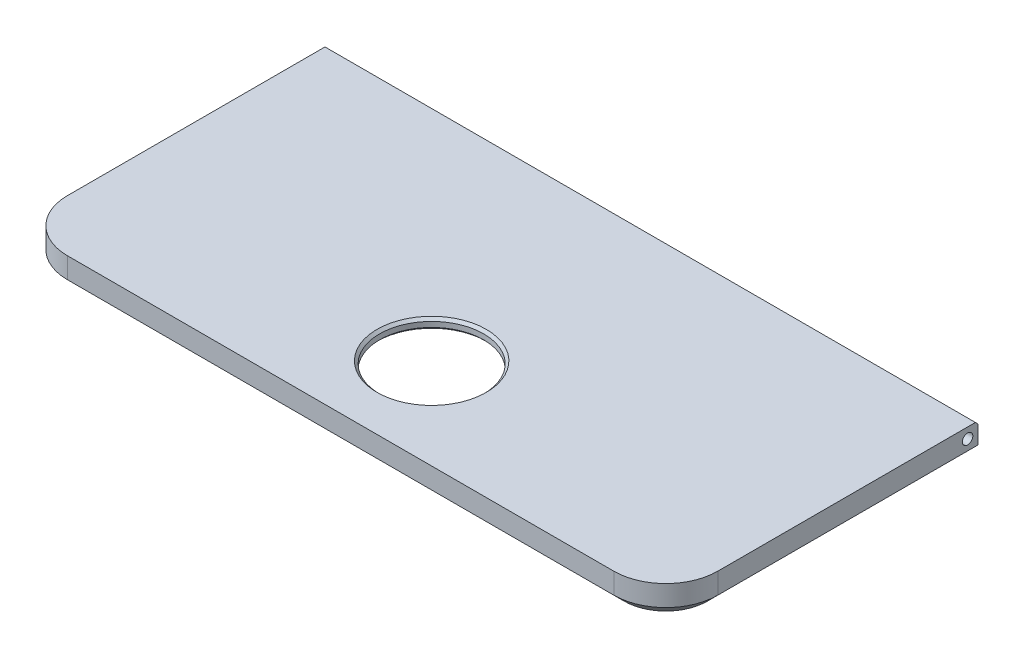
ISO-10303-21;
HEADER;
FILE_DESCRIPTION(('STEP AP214'),'2;1');
FILE_NAME('part.step','',(''),(''),'','','');
FILE_SCHEMA(('AUTOMOTIVE_DESIGN { 1 0 10303 214 1 1 1 1 }'));
ENDSEC;
DATA;
#1=APPLICATION_CONTEXT('core data for automotive mechanical design processes');
#2=APPLICATION_PROTOCOL_DEFINITION('international standard','automotive_design',2000,#1);
#3=PRODUCT_CONTEXT('',#1,'mechanical');
#4=PRODUCT('Part','Part','',(#3));
#5=PRODUCT_RELATED_PRODUCT_CATEGORY('part','',(#4));
#6=PRODUCT_DEFINITION_FORMATION('','',#4);
#7=PRODUCT_DEFINITION_CONTEXT('part definition',#1,'design');
#8=PRODUCT_DEFINITION('design','',#6,#7);
#9=PRODUCT_DEFINITION_SHAPE('','',#8);
#10=(LENGTH_UNIT() NAMED_UNIT(*) SI_UNIT(.MILLI.,.METRE.));
#11=(NAMED_UNIT(*) PLANE_ANGLE_UNIT() SI_UNIT($,.RADIAN.));
#12=(NAMED_UNIT(*) SI_UNIT($,.STERADIAN.) SOLID_ANGLE_UNIT());
#13=UNCERTAINTY_MEASURE_WITH_UNIT(LENGTH_MEASURE(1.E-05),#10,'distance_accuracy_value','');
#14=(GEOMETRIC_REPRESENTATION_CONTEXT(3) GLOBAL_UNCERTAINTY_ASSIGNED_CONTEXT((#13)) GLOBAL_UNIT_ASSIGNED_CONTEXT((#10,
#11,#12)) REPRESENTATION_CONTEXT('',''));
#15=CARTESIAN_POINT('',(0.,0.,0.));
#16=DIRECTION('',(0.,0.,1.));
#17=DIRECTION('',(1.,0.,0.));
#18=AXIS2_PLACEMENT_3D('',#15,#16,#17);
#19=CARTESIAN_POINT('',(59.,4.,-26.5));
#20=DIRECTION('',(1.,0.,0.));
#21=DIRECTION('',(0.,0.,-1.));
#22=AXIS2_PLACEMENT_3D('',#19,#20,#21);
#23=PLANE('',#22);
#24=DIRECTION('',(0.,1.,0.));
#25=VECTOR('',#24,1.);
#26=CARTESIAN_POINT('',(59.,-118.009533513187,-25.));
#27=LINE('',#26,#25);
#28=CARTESIAN_POINT('',(59.,0.,-25.));
#29=VERTEX_POINT('',#28);
#30=CARTESIAN_POINT('',(59.,4.,-25.));
#31=VERTEX_POINT('',#30);
#32=EDGE_CURVE('E148',#29,#31,#27,.T.);
#33=ORIENTED_EDGE('',*,*,#32,.F.);
#34=DIRECTION('',(0.,0.,1.));
#35=VECTOR('',#34,1.);
#36=CARTESIAN_POINT('',(59.,0.,-26.5));
#37=LINE('',#36,#35);
#38=CARTESIAN_POINT('',(59.,0.,20.));
#39=VERTEX_POINT('',#38);
#40=EDGE_CURVE('E162',#29,#39,#37,.T.);
#41=ORIENTED_EDGE('',*,*,#40,.T.);
#42=DIRECTION('',(0.,-1.,0.));
#43=VECTOR('',#42,1.);
#44=CARTESIAN_POINT('',(59.,4.,20.));
#45=LINE('',#44,#43);
#46=CARTESIAN_POINT('',(59.,4.,20.));
#47=VERTEX_POINT('',#46);
#48=EDGE_CURVE('E188',#47,#39,#45,.T.);
#49=ORIENTED_EDGE('',*,*,#48,.F.);
#50=DIRECTION('',(0.,0.,1.));
#51=VECTOR('',#50,1.);
#52=CARTESIAN_POINT('',(59.,4.,-26.5));
#53=LINE('',#52,#51);
#54=EDGE_CURVE('E164',#31,#47,#53,.T.);
#55=ORIENTED_EDGE('',*,*,#54,.F.);
#56=EDGE_LOOP('',(#33,#41,#49,#55));
#57=FACE_BOUND('',#56,.T.);
#58=ADVANCED_FACE('F35',(#57),#23,.F.);
#59=CARTESIAN_POINT('',(-59.,4.,20.));
#60=DIRECTION('',(-1.,0.,0.));
#61=DIRECTION('',(0.,0.,1.));
#62=AXIS2_PLACEMENT_3D('',#59,#60,#61);
#63=PLANE('',#62);
#64=DIRECTION('',(0.,1.,0.));
#65=VECTOR('',#64,1.);
#66=CARTESIAN_POINT('',(-59.,-118.009533513187,-25.));
#67=LINE('',#66,#65);
#68=CARTESIAN_POINT('',(-59.,0.,-25.));
#69=VERTEX_POINT('',#68);
#70=CARTESIAN_POINT('',(-59.,4.,-25.));
#71=VERTEX_POINT('',#70);
#72=EDGE_CURVE('E151',#69,#71,#67,.T.);
#73=ORIENTED_EDGE('',*,*,#72,.T.);
#74=DIRECTION('',(0.,0.,-1.));
#75=VECTOR('',#74,1.);
#76=CARTESIAN_POINT('',(-59.,4.,20.));
#77=LINE('',#76,#75);
#78=CARTESIAN_POINT('',(-59.,4.,20.));
#79=VERTEX_POINT('',#78);
#80=EDGE_CURVE('E599',#79,#71,#77,.T.);
#81=ORIENTED_EDGE('',*,*,#80,.F.);
#82=DIRECTION('',(0.,-1.,0.));
#83=VECTOR('',#82,1.);
#84=CARTESIAN_POINT('',(-59.,4.,20.));
#85=LINE('',#84,#83);
#86=CARTESIAN_POINT('',(-59.,0.,20.));
#87=VERTEX_POINT('',#86);
#88=EDGE_CURVE('E190',#79,#87,#85,.T.);
#89=ORIENTED_EDGE('',*,*,#88,.T.);
#90=DIRECTION('',(0.,0.,-1.));
#91=VECTOR('',#90,1.);
#92=CARTESIAN_POINT('',(-59.,0.,20.));
#93=LINE('',#92,#91);
#94=EDGE_CURVE('E172',#87,#69,#93,.T.);
#95=ORIENTED_EDGE('',*,*,#94,.T.);
#96=EDGE_LOOP('',(#73,#81,#89,#95));
#97=FACE_BOUND('',#96,.T.);
#98=ADVANCED_FACE('F304',(#97),#63,.F.);
#99=CARTESIAN_POINT('',(-52.5,4.,20.));
#100=DIRECTION('',(0.,-1.,0.));
#101=DIRECTION('',(0.,0.,-1.));
#102=AXIS2_PLACEMENT_3D('',#99,#100,#101);
#103=PLANE('',#102);
#104=CARTESIAN_POINT('',(0.,4.,12.5));
#105=DIRECTION('',(0.,-1.,0.));
#106=DIRECTION('',(0.,0.,-1.));
#107=AXIS2_PLACEMENT_3D('',#104,#105,#106);
#108=CIRCLE('',#107,10.5);
#109=CARTESIAN_POINT('',(0.,4.,2.00000000000001));
#110=VERTEX_POINT('',#109);
#111=EDGE_CURVE('E269',#110,#110,#108,.F.);
#112=ORIENTED_EDGE('',*,*,#111,.T.);
#113=EDGE_LOOP('',(#112));
#114=FACE_BOUND('',#113,.T.);
#115=ORIENTED_EDGE('',*,*,#80,.T.);
#116=DIRECTION('',(-1.,0.,0.));
#117=VECTOR('',#116,1.);
#118=CARTESIAN_POINT('',(-59.,4.,-25.));
#119=LINE('',#118,#117);
#120=EDGE_CURVE('E157',#31,#71,#119,.T.);
#121=ORIENTED_EDGE('',*,*,#120,.F.);
#122=ORIENTED_EDGE('',*,*,#54,.T.);
#123=CARTESIAN_POINT('',(52.5,4.,20.));
#124=DIRECTION('',(0.,-1.,0.));
#125=DIRECTION('',(0.,0.,-1.));
#126=AXIS2_PLACEMENT_3D('',#123,#124,#125);
#127=CIRCLE('',#126,6.5);
#128=CARTESIAN_POINT('',(52.5,4.,26.5));
#129=VERTEX_POINT('',#128);
#130=EDGE_CURVE('E595',#47,#129,#127,.T.);
#131=ORIENTED_EDGE('',*,*,#130,.T.);
#132=DIRECTION('',(-1.,0.,0.));
#133=VECTOR('',#132,1.);
#134=CARTESIAN_POINT('',(52.5,4.,26.5));
#135=LINE('',#134,#133);
#136=CARTESIAN_POINT('',(-52.5,4.,26.5));
#137=VERTEX_POINT('',#136);
#138=EDGE_CURVE('E193',#129,#137,#135,.T.);
#139=ORIENTED_EDGE('',*,*,#138,.T.);
#140=CARTESIAN_POINT('',(-52.5,4.,20.));
#141=DIRECTION('',(0.,-1.,0.));
#142=DIRECTION('',(0.,0.,-1.));
#143=AXIS2_PLACEMENT_3D('',#140,#141,#142);
#144=CIRCLE('',#143,6.5);
#145=EDGE_CURVE('E182',#137,#79,#144,.T.);
#146=ORIENTED_EDGE('',*,*,#145,.T.);
#147=EDGE_LOOP('',(#115,#121,#122,#131,#139,#146));
#148=FACE_BOUND('',#147,.T.);
#149=ADVANCED_FACE('F309',(#114,#148),#103,.T.);
#150=CARTESIAN_POINT('',(62.5,6.,30.));
#151=DIRECTION('',(-1.,0.,0.));
#152=DIRECTION('',(0.,0.,1.));
#153=AXIS2_PLACEMENT_3D('',#150,#151,#152);
#154=PLANE('',#153);
#155=CARTESIAN_POINT('',(62.5,4.,-28.));
#156=DIRECTION('',(1.,0.,0.));
#157=DIRECTION('',(0.,0.,-1.));
#158=AXIS2_PLACEMENT_3D('',#155,#156,#157);
#159=CIRCLE('',#158,0.999999999999998);
#160=CARTESIAN_POINT('',(62.5,4.,-29.));
#161=VERTEX_POINT('',#160);
#162=EDGE_CURVE('E607',#161,#161,#159,.T.);
#163=ORIENTED_EDGE('',*,*,#162,.F.);
#164=EDGE_LOOP('',(#163));
#165=FACE_BOUND('',#164,.T.);
#166=DIRECTION('',(0.,-1.,0.));
#167=VECTOR('',#166,1.);
#168=CARTESIAN_POINT('',(62.5,6.,-30.));
#169=LINE('',#168,#167);
#170=CARTESIAN_POINT('',(62.5,5.5,-30.));
#171=VERTEX_POINT('',#170);
#172=CARTESIAN_POINT('',(62.5,2.00000000000003,-30.));
#173=VERTEX_POINT('',#172);
#174=EDGE_CURVE('E203',#171,#173,#169,.T.);
#175=ORIENTED_EDGE('',*,*,#174,.F.);
#176=DIRECTION('',(0.,-0.707106781186557,-0.707106781186538));
#177=VECTOR('',#176,1.);
#178=CARTESIAN_POINT('',(62.5,6.,-29.5));
#179=LINE('',#178,#177);
#180=CARTESIAN_POINT('',(62.5,6.,-29.5));
#181=VERTEX_POINT('',#180);
#182=EDGE_CURVE('E11',#171,#181,#179,.F.);
#183=ORIENTED_EDGE('',*,*,#182,.T.);
#184=DIRECTION('',(0.,0.,-1.));
#185=VECTOR('',#184,1.);
#186=CARTESIAN_POINT('',(62.5,6.,30.));
#187=LINE('',#186,#185);
#188=CARTESIAN_POINT('',(62.5,6.,20.));
#189=VERTEX_POINT('',#188);
#190=EDGE_CURVE('E185',#189,#181,#187,.T.);
#191=ORIENTED_EDGE('',*,*,#190,.F.);
#192=DIRECTION('',(0.,-1.,0.));
#193=VECTOR('',#192,1.);
#194=CARTESIAN_POINT('',(62.5,6.,20.));
#195=LINE('',#194,#193);
#196=CARTESIAN_POINT('',(62.5,2.00000000000003,20.));
#197=VERTEX_POINT('',#196);
#198=EDGE_CURVE('E217',#189,#197,#195,.T.);
#199=ORIENTED_EDGE('',*,*,#198,.T.);
#200=DIRECTION('',(0.,0.,-1.));
#201=VECTOR('',#200,1.);
#202=CARTESIAN_POINT('',(62.5,2.00000000000003,-30.));
#203=LINE('',#202,#201);
#204=EDGE_CURVE('E238',#197,#173,#203,.T.);
#205=ORIENTED_EDGE('',*,*,#204,.T.);
#206=EDGE_LOOP('',(#175,#183,#191,#199,#205));
#207=FACE_BOUND('',#206,.T.);
#208=ADVANCED_FACE('F338',(#165,#207),#154,.F.);
#209=CARTESIAN_POINT('',(-62.5,6.,-30.));
#210=DIRECTION('',(0.,0.,1.));
#211=DIRECTION('',(1.,0.,0.));
#212=AXIS2_PLACEMENT_3D('',#209,#210,#211);
#213=PLANE('',#212);
#214=DIRECTION('',(0.,-1.,0.));
#215=VECTOR('',#214,1.);
#216=CARTESIAN_POINT('',(-62.5,6.,-30.));
#217=LINE('',#216,#215);
#218=CARTESIAN_POINT('',(-62.5,5.5,-30.));
#219=VERTEX_POINT('',#218);
#220=CARTESIAN_POINT('',(-62.5,2.00000000000003,-30.));
#221=VERTEX_POINT('',#220);
#222=EDGE_CURVE('E201',#219,#221,#217,.T.);
#223=ORIENTED_EDGE('',*,*,#222,.F.);
#224=DIRECTION('',(1.,0.,0.));
#225=VECTOR('',#224,1.);
#226=CARTESIAN_POINT('',(-62.5,5.5,-30.));
#227=LINE('',#226,#225);
#228=EDGE_CURVE('E43',#219,#171,#227,.T.);
#229=ORIENTED_EDGE('',*,*,#228,.T.);
#230=ORIENTED_EDGE('',*,*,#174,.T.);
#231=DIRECTION('',(-1.,0.,0.));
#232=VECTOR('',#231,1.);
#233=CARTESIAN_POINT('',(-62.5,2.00000000000003,-30.));
#234=LINE('',#233,#232);
#235=EDGE_CURVE('E220',#173,#221,#234,.T.);
#236=ORIENTED_EDGE('',*,*,#235,.T.);
#237=EDGE_LOOP('',(#223,#229,#230,#236));
#238=FACE_BOUND('',#237,.T.);
#239=ADVANCED_FACE('F334',(#238),#213,.F.);
#240=CARTESIAN_POINT('',(-62.5,6.,30.));
#241=DIRECTION('',(1.,0.,0.));
#242=DIRECTION('',(0.,0.,-1.));
#243=AXIS2_PLACEMENT_3D('',#240,#241,#242);
#244=PLANE('',#243);
#245=CARTESIAN_POINT('',(-62.5,4.,-28.));
#246=DIRECTION('',(-1.,0.,0.));
#247=DIRECTION('',(0.,0.,1.));
#248=AXIS2_PLACEMENT_3D('',#245,#246,#247);
#249=CIRCLE('',#248,0.999999999999998);
#250=CARTESIAN_POINT('',(-62.5,4.,-27.));
#251=VERTEX_POINT('',#250);
#252=EDGE_CURVE('E613',#251,#251,#249,.T.);
#253=ORIENTED_EDGE('',*,*,#252,.F.);
#254=EDGE_LOOP('',(#253));
#255=FACE_BOUND('',#254,.T.);
#256=DIRECTION('',(0.,0.,1.));
#257=VECTOR('',#256,1.);
#258=CARTESIAN_POINT('',(-62.5,6.,30.));
#259=LINE('',#258,#257);
#260=CARTESIAN_POINT('',(-62.5,6.,-29.5));
#261=VERTEX_POINT('',#260);
#262=CARTESIAN_POINT('',(-62.5,6.,20.));
#263=VERTEX_POINT('',#262);
#264=EDGE_CURVE('E196',#261,#263,#259,.T.);
#265=ORIENTED_EDGE('',*,*,#264,.F.);
#266=DIRECTION('',(0.,0.707106781186557,0.707106781186538));
#267=VECTOR('',#266,1.);
#268=CARTESIAN_POINT('',(-62.5,6.,-29.5));
#269=LINE('',#268,#267);
#270=EDGE_CURVE('E57',#261,#219,#269,.F.);
#271=ORIENTED_EDGE('',*,*,#270,.T.);
#272=ORIENTED_EDGE('',*,*,#222,.T.);
#273=DIRECTION('',(0.,0.,1.));
#274=VECTOR('',#273,1.);
#275=CARTESIAN_POINT('',(-62.5,2.00000000000003,20.));
#276=LINE('',#275,#274);
#277=CARTESIAN_POINT('',(-62.5,2.00000000000003,20.));
#278=VERTEX_POINT('',#277);
#279=EDGE_CURVE('E236',#221,#278,#276,.T.);
#280=ORIENTED_EDGE('',*,*,#279,.T.);
#281=DIRECTION('',(0.,-1.,0.));
#282=VECTOR('',#281,1.);
#283=CARTESIAN_POINT('',(-62.5,6.,20.));
#284=LINE('',#283,#282);
#285=EDGE_CURVE('E210',#278,#263,#284,.F.);
#286=ORIENTED_EDGE('',*,*,#285,.T.);
#287=EDGE_LOOP('',(#265,#271,#272,#280,#286));
#288=FACE_BOUND('',#287,.T.);
#289=ADVANCED_FACE('F330',(#255,#288),#244,.F.);
#290=CARTESIAN_POINT('',(-62.5,6.,30.));
#291=DIRECTION('',(0.,0.,-1.));
#292=DIRECTION('',(-1.,0.,0.));
#293=AXIS2_PLACEMENT_3D('',#290,#291,#292);
#294=PLANE('',#293);
#295=DIRECTION('',(0.,-1.,0.));
#296=VECTOR('',#295,1.);
#297=CARTESIAN_POINT('',(-52.5,6.,30.));
#298=LINE('',#297,#296);
#299=CARTESIAN_POINT('',(-52.5,6.,30.));
#300=VERTEX_POINT('',#299);
#301=CARTESIAN_POINT('',(-52.5,2.00000000000003,30.));
#302=VERTEX_POINT('',#301);
#303=EDGE_CURVE('E207',#300,#302,#298,.T.);
#304=ORIENTED_EDGE('',*,*,#303,.T.);
#305=DIRECTION('',(1.,0.,0.));
#306=VECTOR('',#305,1.);
#307=CARTESIAN_POINT('',(52.5,2.00000000000003,30.));
#308=LINE('',#307,#306);
#309=CARTESIAN_POINT('',(52.5,2.00000000000003,30.));
#310=VERTEX_POINT('',#309);
#311=EDGE_CURVE('E245',#302,#310,#308,.T.);
#312=ORIENTED_EDGE('',*,*,#311,.T.);
#313=DIRECTION('',(0.,-1.,0.));
#314=VECTOR('',#313,1.);
#315=CARTESIAN_POINT('',(52.5,6.,30.));
#316=LINE('',#315,#314);
#317=CARTESIAN_POINT('',(52.5,6.,30.));
#318=VERTEX_POINT('',#317);
#319=EDGE_CURVE('E205',#310,#318,#316,.F.);
#320=ORIENTED_EDGE('',*,*,#319,.T.);
#321=DIRECTION('',(1.,0.,0.));
#322=VECTOR('',#321,1.);
#323=CARTESIAN_POINT('',(-62.5,6.,30.));
#324=LINE('',#323,#322);
#325=EDGE_CURVE('E198',#300,#318,#324,.T.);
#326=ORIENTED_EDGE('',*,*,#325,.F.);
#327=EDGE_LOOP('',(#304,#312,#320,#326));
#328=FACE_BOUND('',#327,.T.);
#329=ADVANCED_FACE('F324',(#328),#294,.F.);
#330=CARTESIAN_POINT('',(0.,6.,0.));
#331=DIRECTION('',(0.,-1.,0.));
#332=DIRECTION('',(0.,0.,-1.));
#333=AXIS2_PLACEMENT_3D('',#330,#331,#332);
#334=PLANE('',#333);
#335=CARTESIAN_POINT('',(0.,6.,12.5));
#336=DIRECTION('',(0.,-1.,0.));
#337=DIRECTION('',(0.,0.,-1.));
#338=AXIS2_PLACEMENT_3D('',#335,#336,#337);
#339=CIRCLE('',#338,10.5);
#340=CARTESIAN_POINT('',(0.,6.,1.99999999999997));
#341=VERTEX_POINT('',#340);
#342=EDGE_CURVE('E275',#341,#341,#339,.T.);
#343=ORIENTED_EDGE('',*,*,#342,.T.);
#344=EDGE_LOOP('',(#343));
#345=FACE_BOUND('',#344,.T.);
#346=ORIENTED_EDGE('',*,*,#190,.T.);
#347=DIRECTION('',(-1.,0.,0.));
#348=VECTOR('',#347,1.);
#349=CARTESIAN_POINT('',(0.,6.,-29.5));
#350=LINE('',#349,#348);
#351=EDGE_CURVE('E272',#181,#261,#350,.T.);
#352=ORIENTED_EDGE('',*,*,#351,.T.);
#353=ORIENTED_EDGE('',*,*,#264,.T.);
#354=CARTESIAN_POINT('',(-52.5,6.,20.));
#355=DIRECTION('',(0.,-1.,0.));
#356=DIRECTION('',(0.,0.,-1.));
#357=AXIS2_PLACEMENT_3D('',#354,#355,#356);
#358=CIRCLE('',#357,10.);
#359=EDGE_CURVE('E215',#263,#300,#358,.F.);
#360=ORIENTED_EDGE('',*,*,#359,.T.);
#361=ORIENTED_EDGE('',*,*,#325,.T.);
#362=CARTESIAN_POINT('',(52.5,6.,20.));
#363=DIRECTION('',(0.,-1.,0.));
#364=DIRECTION('',(0.,0.,-1.));
#365=AXIS2_PLACEMENT_3D('',#362,#363,#364);
#366=CIRCLE('',#365,10.);
#367=EDGE_CURVE('E213',#318,#189,#366,.F.);
#368=ORIENTED_EDGE('',*,*,#367,.T.);
#369=EDGE_LOOP('',(#346,#352,#353,#360,#361,#368));
#370=FACE_BOUND('',#369,.T.);
#371=ADVANCED_FACE('F280',(#345,#370),#334,.F.);
#372=CARTESIAN_POINT('',(0.,0.,0.));
#373=DIRECTION('',(0.,-1.,0.));
#374=DIRECTION('',(0.,0.,-1.));
#375=AXIS2_PLACEMENT_3D('',#372,#373,#374);
#376=PLANE('',#375);
#377=ORIENTED_EDGE('',*,*,#40,.F.);
#378=DIRECTION('',(-1.,0.,0.));
#379=VECTOR('',#378,1.);
#380=CARTESIAN_POINT('',(-59.,0.,-25.));
#381=LINE('',#380,#379);
#382=EDGE_CURVE('E145',#29,#69,#381,.T.);
#383=ORIENTED_EDGE('',*,*,#382,.T.);
#384=ORIENTED_EDGE('',*,*,#94,.F.);
#385=CARTESIAN_POINT('',(-52.5,0.,20.));
#386=DIRECTION('',(0.,-1.,0.));
#387=DIRECTION('',(0.,0.,-1.));
#388=AXIS2_PLACEMENT_3D('',#385,#386,#387);
#389=CIRCLE('',#388,6.5);
#390=CARTESIAN_POINT('',(-52.5,0.,26.5));
#391=VERTEX_POINT('',#390);
#392=EDGE_CURVE('E176',#391,#87,#389,.T.);
#393=ORIENTED_EDGE('',*,*,#392,.F.);
#394=DIRECTION('',(-1.,0.,0.));
#395=VECTOR('',#394,1.);
#396=CARTESIAN_POINT('',(52.5,0.,26.5));
#397=LINE('',#396,#395);
#398=CARTESIAN_POINT('',(52.5,0.,26.5));
#399=VERTEX_POINT('',#398);
#400=EDGE_CURVE('E174',#399,#391,#397,.T.);
#401=ORIENTED_EDGE('',*,*,#400,.F.);
#402=CARTESIAN_POINT('',(52.5,0.,20.));
#403=DIRECTION('',(0.,-1.,0.));
#404=DIRECTION('',(0.,0.,-1.));
#405=AXIS2_PLACEMENT_3D('',#402,#403,#404);
#406=CIRCLE('',#405,6.5);
#407=EDGE_CURVE('E171',#39,#399,#406,.T.);
#408=ORIENTED_EDGE('',*,*,#407,.F.);
#409=EDGE_LOOP('',(#377,#383,#384,#393,#401,#408));
#410=FACE_BOUND('',#409,.T.);
#411=DIRECTION('',(0.,0.,-1.));
#412=VECTOR('',#411,1.);
#413=CARTESIAN_POINT('',(-60.5,0.,-30.));
#414=LINE('',#413,#412);
#415=CARTESIAN_POINT('',(-60.5,0.,20.));
#416=VERTEX_POINT('',#415);
#417=CARTESIAN_POINT('',(-60.5,0.,-28.));
#418=VERTEX_POINT('',#417);
#419=EDGE_CURVE('E231',#416,#418,#414,.T.);
#420=ORIENTED_EDGE('',*,*,#419,.T.);
#421=DIRECTION('',(1.,0.,0.));
#422=VECTOR('',#421,1.);
#423=CARTESIAN_POINT('',(62.5,0.,-28.));
#424=LINE('',#423,#422);
#425=CARTESIAN_POINT('',(60.5,0.,-28.));
#426=VERTEX_POINT('',#425);
#427=EDGE_CURVE('E233',#418,#426,#424,.T.);
#428=ORIENTED_EDGE('',*,*,#427,.T.);
#429=DIRECTION('',(0.,0.,1.));
#430=VECTOR('',#429,1.);
#431=CARTESIAN_POINT('',(60.5,0.,20.));
#432=LINE('',#431,#430);
#433=CARTESIAN_POINT('',(60.5,0.,20.));
#434=VERTEX_POINT('',#433);
#435=EDGE_CURVE('E229',#426,#434,#432,.T.);
#436=ORIENTED_EDGE('',*,*,#435,.T.);
#437=CARTESIAN_POINT('',(52.5,0.,20.));
#438=DIRECTION('',(0.,-1.,0.));
#439=DIRECTION('',(0.,0.,-1.));
#440=AXIS2_PLACEMENT_3D('',#437,#438,#439);
#441=CIRCLE('',#440,7.99999999999996);
#442=CARTESIAN_POINT('',(52.5,0.,28.));
#443=VERTEX_POINT('',#442);
#444=EDGE_CURVE('E225',#434,#443,#441,.T.);
#445=ORIENTED_EDGE('',*,*,#444,.T.);
#446=DIRECTION('',(-1.,0.,0.));
#447=VECTOR('',#446,1.);
#448=CARTESIAN_POINT('',(-52.5,0.,28.));
#449=LINE('',#448,#447);
#450=CARTESIAN_POINT('',(-52.5,0.,28.));
#451=VERTEX_POINT('',#450);
#452=EDGE_CURVE('E223',#443,#451,#449,.T.);
#453=ORIENTED_EDGE('',*,*,#452,.T.);
#454=CARTESIAN_POINT('',(-52.5,0.,20.));
#455=DIRECTION('',(0.,-1.,0.));
#456=DIRECTION('',(0.,0.,-1.));
#457=AXIS2_PLACEMENT_3D('',#454,#455,#456);
#458=CIRCLE('',#457,7.99999999999996);
#459=EDGE_CURVE('E227',#451,#416,#458,.T.);
#460=ORIENTED_EDGE('',*,*,#459,.T.);
#461=EDGE_LOOP('',(#420,#428,#436,#445,#453,#460));
#462=FACE_BOUND('',#461,.T.);
#463=ADVANCED_FACE('F167',(#410,#462),#376,.T.);
#464=CARTESIAN_POINT('',(-52.5,6.,20.));
#465=DIRECTION('',(0.,-1.,0.));
#466=DIRECTION('',(0.,0.,-1.));
#467=AXIS2_PLACEMENT_3D('',#464,#465,#466);
#468=CYLINDRICAL_SURFACE('',#467,10.);
#469=ORIENTED_EDGE('',*,*,#285,.F.);
#470=CARTESIAN_POINT('',(-52.5,2.00000000000003,20.));
#471=DIRECTION('',(0.,-1.,0.));
#472=DIRECTION('',(0.,0.,-1.));
#473=AXIS2_PLACEMENT_3D('',#470,#471,#472);
#474=CIRCLE('',#473,10.);
#475=EDGE_CURVE('E241',#278,#302,#474,.F.);
#476=ORIENTED_EDGE('',*,*,#475,.T.);
#477=ORIENTED_EDGE('',*,*,#303,.F.);
#478=ORIENTED_EDGE('',*,*,#359,.F.);
#479=EDGE_LOOP('',(#469,#476,#477,#478));
#480=FACE_BOUND('',#479,.T.);
#481=ADVANCED_FACE('F327',(#480),#468,.T.);
#482=CARTESIAN_POINT('',(52.5,6.,20.));
#483=DIRECTION('',(0.,-1.,0.));
#484=DIRECTION('',(0.,0.,-1.));
#485=AXIS2_PLACEMENT_3D('',#482,#483,#484);
#486=CYLINDRICAL_SURFACE('',#485,10.);
#487=ORIENTED_EDGE('',*,*,#319,.F.);
#488=CARTESIAN_POINT('',(52.5,2.00000000000003,20.));
#489=DIRECTION('',(0.,-1.,0.));
#490=DIRECTION('',(0.,0.,-1.));
#491=AXIS2_PLACEMENT_3D('',#488,#489,#490);
#492=CIRCLE('',#491,10.);
#493=EDGE_CURVE('E243',#310,#197,#492,.F.);
#494=ORIENTED_EDGE('',*,*,#493,.T.);
#495=ORIENTED_EDGE('',*,*,#198,.F.);
#496=ORIENTED_EDGE('',*,*,#367,.F.);
#497=EDGE_LOOP('',(#487,#494,#495,#496));
#498=FACE_BOUND('',#497,.T.);
#499=ADVANCED_FACE('F320',(#498),#486,.T.);
#500=CARTESIAN_POINT('',(-52.5,4.,20.));
#501=DIRECTION('',(0.,-1.,0.));
#502=DIRECTION('',(0.,0.,-1.));
#503=AXIS2_PLACEMENT_3D('',#500,#501,#502);
#504=CYLINDRICAL_SURFACE('',#503,6.5);
#505=ORIENTED_EDGE('',*,*,#392,.T.);
#506=ORIENTED_EDGE('',*,*,#88,.F.);
#507=ORIENTED_EDGE('',*,*,#145,.F.);
#508=DIRECTION('',(0.,-1.,0.));
#509=VECTOR('',#508,1.);
#510=CARTESIAN_POINT('',(-52.5,4.,26.5));
#511=LINE('',#510,#509);
#512=EDGE_CURVE('E183',#137,#391,#511,.T.);
#513=ORIENTED_EDGE('',*,*,#512,.T.);
#514=EDGE_LOOP('',(#505,#506,#507,#513));
#515=FACE_BOUND('',#514,.T.);
#516=ADVANCED_FACE('F316',(#515),#504,.F.);
#517=CARTESIAN_POINT('',(52.5,4.,26.5));
#518=DIRECTION('',(0.,0.,1.));
#519=DIRECTION('',(1.,0.,0.));
#520=AXIS2_PLACEMENT_3D('',#517,#518,#519);
#521=PLANE('',#520);
#522=ORIENTED_EDGE('',*,*,#400,.T.);
#523=ORIENTED_EDGE('',*,*,#512,.F.);
#524=ORIENTED_EDGE('',*,*,#138,.F.);
#525=DIRECTION('',(0.,-1.,0.));
#526=VECTOR('',#525,1.);
#527=CARTESIAN_POINT('',(52.5,4.,26.5));
#528=LINE('',#527,#526);
#529=EDGE_CURVE('E186',#129,#399,#528,.T.);
#530=ORIENTED_EDGE('',*,*,#529,.T.);
#531=EDGE_LOOP('',(#522,#523,#524,#530));
#532=FACE_BOUND('',#531,.T.);
#533=ADVANCED_FACE('F319',(#532),#521,.F.);
#534=CARTESIAN_POINT('',(52.5,4.,20.));
#535=DIRECTION('',(0.,-1.,0.));
#536=DIRECTION('',(0.,0.,-1.));
#537=AXIS2_PLACEMENT_3D('',#534,#535,#536);
#538=CYLINDRICAL_SURFACE('',#537,6.5);
#539=ORIENTED_EDGE('',*,*,#407,.T.);
#540=ORIENTED_EDGE('',*,*,#529,.F.);
#541=ORIENTED_EDGE('',*,*,#130,.F.);
#542=ORIENTED_EDGE('',*,*,#48,.T.);
#543=EDGE_LOOP('',(#539,#540,#541,#542));
#544=FACE_BOUND('',#543,.T.);
#545=ADVANCED_FACE('F313',(#544),#538,.F.);
#546=CARTESIAN_POINT('',(-62.5,2.00000000000003,30.));
#547=DIRECTION('',(0.,-0.70710678118655,0.707106781186545));
#548=DIRECTION('',(-1.,0.,0.));
#549=AXIS2_PLACEMENT_3D('',#546,#547,#548);
#550=PLANE('',#549);
#551=DIRECTION('',(0.,0.707106781186545,0.70710678118655));
#552=VECTOR('',#551,1.);
#553=CARTESIAN_POINT('',(-52.5,0.,28.));
#554=LINE('',#553,#552);
#555=EDGE_CURVE('E258',#451,#302,#554,.T.);
#556=ORIENTED_EDGE('',*,*,#555,.F.);
#557=ORIENTED_EDGE('',*,*,#452,.F.);
#558=DIRECTION('',(0.,-0.707106781186545,-0.70710678118655));
#559=VECTOR('',#558,1.);
#560=CARTESIAN_POINT('',(52.5,2.00000000000003,30.));
#561=LINE('',#560,#559);
#562=EDGE_CURVE('E261',#310,#443,#561,.T.);
#563=ORIENTED_EDGE('',*,*,#562,.F.);
#564=ORIENTED_EDGE('',*,*,#311,.F.);
#565=EDGE_LOOP('',(#556,#557,#563,#564));
#566=FACE_BOUND('',#565,.T.);
#567=ADVANCED_FACE('F367',(#566),#550,.T.);
#568=CARTESIAN_POINT('',(52.5,0.,20.));
#569=DIRECTION('',(0.,1.,0.));
#570=DIRECTION('',(0.,0.,1.));
#571=AXIS2_PLACEMENT_3D('',#568,#569,#570);
#572=CONICAL_SURFACE('',#571,7.99999999999996,0.785398163397451);
#573=ORIENTED_EDGE('',*,*,#562,.T.);
#574=ORIENTED_EDGE('',*,*,#444,.F.);
#575=DIRECTION('',(-0.70710678118655,-0.707106781186545,0.));
#576=VECTOR('',#575,1.);
#577=CARTESIAN_POINT('',(62.5,2.00000000000003,20.));
#578=LINE('',#577,#576);
#579=EDGE_CURVE('E255',#197,#434,#578,.T.);
#580=ORIENTED_EDGE('',*,*,#579,.F.);
#581=ORIENTED_EDGE('',*,*,#493,.F.);
#582=EDGE_LOOP('',(#573,#574,#580,#581));
#583=FACE_BOUND('',#582,.T.);
#584=ADVANCED_FACE('F363',(#583),#572,.T.);
#585=CARTESIAN_POINT('',(-52.5,0.,20.));
#586=DIRECTION('',(0.,1.,0.));
#587=DIRECTION('',(0.,0.,1.));
#588=AXIS2_PLACEMENT_3D('',#585,#586,#587);
#589=CONICAL_SURFACE('',#588,7.99999999999996,0.785398163397451);
#590=ORIENTED_EDGE('',*,*,#555,.T.);
#591=ORIENTED_EDGE('',*,*,#475,.F.);
#592=DIRECTION('',(-0.70710678118655,0.707106781186545,0.));
#593=VECTOR('',#592,1.);
#594=CARTESIAN_POINT('',(-60.5,0.,20.));
#595=LINE('',#594,#593);
#596=EDGE_CURVE('E252',#416,#278,#595,.T.);
#597=ORIENTED_EDGE('',*,*,#596,.F.);
#598=ORIENTED_EDGE('',*,*,#459,.F.);
#599=EDGE_LOOP('',(#590,#591,#597,#598));
#600=FACE_BOUND('',#599,.T.);
#601=ADVANCED_FACE('F359',(#600),#589,.T.);
#602=CARTESIAN_POINT('',(62.5,2.00000000000003,30.));
#603=DIRECTION('',(0.707106781186545,-0.70710678118655,0.));
#604=DIRECTION('',(0.,0.,1.));
#605=AXIS2_PLACEMENT_3D('',#602,#603,#604);
#606=PLANE('',#605);
#607=ORIENTED_EDGE('',*,*,#579,.T.);
#608=ORIENTED_EDGE('',*,*,#435,.F.);
#609=DIRECTION('',(0.577350269189627,0.577350269189623,-0.577350269189627));
#610=VECTOR('',#609,1.);
#611=CARTESIAN_POINT('',(42.4999999999999,-17.9999999999999,-9.99999999999991));
#612=LINE('',#611,#610);
#613=EDGE_CURVE('E250',#173,#426,#612,.F.);
#614=ORIENTED_EDGE('',*,*,#613,.F.);
#615=ORIENTED_EDGE('',*,*,#204,.F.);
#616=EDGE_LOOP('',(#607,#608,#614,#615));
#617=FACE_BOUND('',#616,.T.);
#618=ADVANCED_FACE('F355',(#617),#606,.T.);
#619=CARTESIAN_POINT('',(-62.5,2.00000000000003,30.));
#620=DIRECTION('',(-0.707106781186545,-0.70710678118655,0.));
#621=DIRECTION('',(0.,0.,-1.));
#622=AXIS2_PLACEMENT_3D('',#619,#620,#621);
#623=PLANE('',#622);
#624=ORIENTED_EDGE('',*,*,#596,.T.);
#625=ORIENTED_EDGE('',*,*,#279,.F.);
#626=DIRECTION('',(0.577350269189627,-0.577350269189623,0.577350269189627));
#627=VECTOR('',#626,1.);
#628=CARTESIAN_POINT('',(-42.4999999999999,-17.9999999999999,-9.99999999999991));
#629=LINE('',#628,#627);
#630=EDGE_CURVE('E156',#418,#221,#629,.F.);
#631=ORIENTED_EDGE('',*,*,#630,.F.);
#632=ORIENTED_EDGE('',*,*,#419,.F.);
#633=EDGE_LOOP('',(#624,#625,#631,#632));
#634=FACE_BOUND('',#633,.T.);
#635=ADVANCED_FACE('F351',(#634),#623,.T.);
#636=CARTESIAN_POINT('',(-62.5,2.00000000000003,-30.));
#637=DIRECTION('',(0.,-0.70710678118655,-0.707106781186545));
#638=DIRECTION('',(1.,0.,0.));
#639=AXIS2_PLACEMENT_3D('',#636,#637,#638);
#640=PLANE('',#639);
#641=ORIENTED_EDGE('',*,*,#613,.T.);
#642=ORIENTED_EDGE('',*,*,#427,.F.);
#643=ORIENTED_EDGE('',*,*,#630,.T.);
#644=ORIENTED_EDGE('',*,*,#235,.F.);
#645=EDGE_LOOP('',(#641,#642,#643,#644));
#646=FACE_BOUND('',#645,.T.);
#647=ADVANCED_FACE('F348',(#646),#640,.T.);
#648=CARTESIAN_POINT('',(-59.,-118.009533513187,-25.));
#649=DIRECTION('',(0.,0.,-1.));
#650=DIRECTION('',(-1.,0.,0.));
#651=AXIS2_PLACEMENT_3D('',#648,#649,#650);
#652=PLANE('',#651);
#653=ORIENTED_EDGE('',*,*,#382,.F.);
#654=ORIENTED_EDGE('',*,*,#32,.T.);
#655=ORIENTED_EDGE('',*,*,#120,.T.);
#656=ORIENTED_EDGE('',*,*,#72,.F.);
#657=EDGE_LOOP('',(#653,#654,#655,#656));
#658=FACE_BOUND('',#657,.T.);
#659=ADVANCED_FACE('F147',(#658),#652,.F.);
#660=CARTESIAN_POINT('',(52.5,4.,-28.));
#661=DIRECTION('',(1.,0.,0.));
#662=DIRECTION('',(0.,0.,-1.));
#663=AXIS2_PLACEMENT_3D('',#660,#661,#662);
#664=CYLINDRICAL_SURFACE('',#663,0.999999999999998);
#665=CARTESIAN_POINT('',(52.5,4.,-28.));
#666=DIRECTION('',(1.,0.,0.));
#667=DIRECTION('',(0.,0.,-1.));
#668=AXIS2_PLACEMENT_3D('',#665,#666,#667);
#669=CIRCLE('',#668,0.999999999999998);
#670=CARTESIAN_POINT('',(52.5,4.,-29.));
#671=VERTEX_POINT('',#670);
#672=EDGE_CURVE('E604',#671,#671,#669,.T.);
#673=ORIENTED_EDGE('',*,*,#672,.F.);
#674=EDGE_LOOP('',(#673));
#675=FACE_BOUND('',#674,.T.);
#676=ORIENTED_EDGE('',*,*,#162,.T.);
#677=EDGE_LOOP('',(#676));
#678=FACE_BOUND('',#677,.T.);
#679=ADVANCED_FACE('F482',(#675,#678),#664,.F.);
#680=CARTESIAN_POINT('',(52.5,4.,-28.));
#681=DIRECTION('',(1.,0.,0.));
#682=DIRECTION('',(0.,0.,-1.));
#683=AXIS2_PLACEMENT_3D('',#680,#681,#682);
#684=PLANE('',#683);
#685=ORIENTED_EDGE('',*,*,#672,.T.);
#686=EDGE_LOOP('',(#685));
#687=FACE_BOUND('',#686,.T.);
#688=ADVANCED_FACE('F472',(#687),#684,.T.);
#689=CARTESIAN_POINT('',(-52.5,4.,-28.));
#690=DIRECTION('',(-1.,0.,0.));
#691=DIRECTION('',(0.,0.,1.));
#692=AXIS2_PLACEMENT_3D('',#689,#690,#691);
#693=CYLINDRICAL_SURFACE('',#692,0.999999999999998);
#694=CARTESIAN_POINT('',(-52.5,4.,-28.));
#695=DIRECTION('',(-1.,0.,0.));
#696=DIRECTION('',(0.,0.,1.));
#697=AXIS2_PLACEMENT_3D('',#694,#695,#696);
#698=CIRCLE('',#697,0.999999999999998);
#699=CARTESIAN_POINT('',(-52.5,4.,-27.));
#700=VERTEX_POINT('',#699);
#701=EDGE_CURVE('E610',#700,#700,#698,.T.);
#702=ORIENTED_EDGE('',*,*,#701,.F.);
#703=EDGE_LOOP('',(#702));
#704=FACE_BOUND('',#703,.T.);
#705=ORIENTED_EDGE('',*,*,#252,.T.);
#706=EDGE_LOOP('',(#705));
#707=FACE_BOUND('',#706,.T.);
#708=ADVANCED_FACE('F300',(#704,#707),#693,.F.);
#709=CARTESIAN_POINT('',(-52.5,4.,-28.));
#710=DIRECTION('',(-1.,0.,0.));
#711=DIRECTION('',(0.,0.,1.));
#712=AXIS2_PLACEMENT_3D('',#709,#710,#711);
#713=PLANE('',#712);
#714=ORIENTED_EDGE('',*,*,#701,.T.);
#715=EDGE_LOOP('',(#714));
#716=FACE_BOUND('',#715,.T.);
#717=ADVANCED_FACE('F291',(#716),#713,.T.);
#718=CARTESIAN_POINT('',(0.,34.2842712474619,12.5));
#719=DIRECTION('',(0.,-1.,0.));
#720=DIRECTION('',(0.,0.,-1.));
#721=AXIS2_PLACEMENT_3D('',#718,#719,#720);
#722=CYLINDRICAL_SURFACE('',#721,10.);
#723=CARTESIAN_POINT('',(0.,4.5,12.5));
#724=DIRECTION('',(0.,-1.,0.));
#725=DIRECTION('',(0.,0.,-1.));
#726=AXIS2_PLACEMENT_3D('',#723,#724,#725);
#727=CIRCLE('',#726,10.);
#728=CARTESIAN_POINT('',(0.,4.5,2.5));
#729=VERTEX_POINT('',#728);
#730=EDGE_CURVE('E266',#729,#729,#727,.T.);
#731=ORIENTED_EDGE('',*,*,#730,.T.);
#732=EDGE_LOOP('',(#731));
#733=FACE_BOUND('',#732,.T.);
#734=CARTESIAN_POINT('',(0.,5.49999999999998,12.5));
#735=DIRECTION('',(0.,-1.,0.));
#736=DIRECTION('',(0.,0.,-1.));
#737=AXIS2_PLACEMENT_3D('',#734,#735,#736);
#738=CIRCLE('',#737,10.);
#739=CARTESIAN_POINT('',(0.,5.49999999999998,2.5));
#740=VERTEX_POINT('',#739);
#741=EDGE_CURVE('E247',#740,#740,#738,.F.);
#742=ORIENTED_EDGE('',*,*,#741,.T.);
#743=EDGE_LOOP('',(#742));
#744=FACE_BOUND('',#743,.T.);
#745=ADVANCED_FACE('F289',(#733,#744),#722,.F.);
#746=CARTESIAN_POINT('',(0.,4.5,12.5));
#747=DIRECTION('',(0.,-1.,0.));
#748=DIRECTION('',(0.,0.,-1.));
#749=AXIS2_PLACEMENT_3D('',#746,#747,#748);
#750=CONICAL_SURFACE('',#749,10.,0.785398163397441);
#751=ORIENTED_EDGE('',*,*,#111,.F.);
#752=EDGE_LOOP('',(#751));
#753=FACE_BOUND('',#752,.T.);
#754=ORIENTED_EDGE('',*,*,#730,.F.);
#755=EDGE_LOOP('',(#754));
#756=FACE_BOUND('',#755,.T.);
#757=ADVANCED_FACE('F286',(#753,#756),#750,.F.);
#758=CARTESIAN_POINT('',(0.,5.49999999999998,12.5));
#759=DIRECTION('',(0.,1.,0.));
#760=DIRECTION('',(0.,0.,1.));
#761=AXIS2_PLACEMENT_3D('',#758,#759,#760);
#762=CONICAL_SURFACE('',#761,10.,0.785398163397459);
#763=ORIENTED_EDGE('',*,*,#342,.F.);
#764=EDGE_LOOP('',(#763));
#765=FACE_BOUND('',#764,.T.);
#766=ORIENTED_EDGE('',*,*,#741,.F.);
#767=EDGE_LOOP('',(#766));
#768=FACE_BOUND('',#767,.T.);
#769=ADVANCED_FACE('F283',(#765,#768),#762,.F.);
#770=CARTESIAN_POINT('',(0.,6.,-29.5));
#771=DIRECTION('',(0.,-0.707106781186538,0.707106781186557));
#772=DIRECTION('',(-1.,0.,0.));
#773=AXIS2_PLACEMENT_3D('',#770,#771,#772);
#774=PLANE('',#773);
#775=ORIENTED_EDGE('',*,*,#182,.F.);
#776=ORIENTED_EDGE('',*,*,#228,.F.);
#777=ORIENTED_EDGE('',*,*,#270,.F.);
#778=ORIENTED_EDGE('',*,*,#351,.F.);
#779=EDGE_LOOP('',(#775,#776,#777,#778));
#780=FACE_BOUND('',#779,.T.);
#781=ADVANCED_FACE('F37',(#780),#774,.F.);
#782=CLOSED_SHELL('',(#58,#98,#149,#208,#239,#289,#329,#371,#463,#481,#499,#516,#533,#545,#567,
#584,#601,#618,#635,#647,#659,#679,#688,#708,#717,#745,#757,#769,#781));
#783=MANIFOLD_SOLID_BREP('B2',#782);
#784=ADVANCED_BREP_SHAPE_REPRESENTATION('',(#18,#783),#14);
#785=SHAPE_DEFINITION_REPRESENTATION(#9,#784);
ENDSEC;
END-ISO-10303-21;
